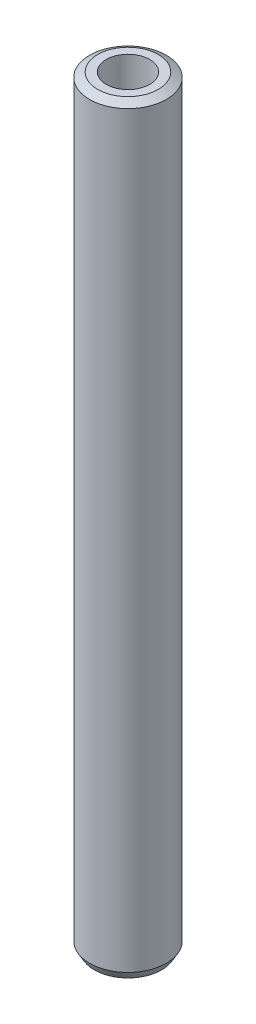
ISO-10303-21;
HEADER;
FILE_DESCRIPTION(('STEP AP214'),'2;1');
FILE_NAME('part.step','',(''),(''),'','','');
FILE_SCHEMA(('AUTOMOTIVE_DESIGN { 1 0 10303 214 1 1 1 1 }'));
ENDSEC;
DATA;
#1=APPLICATION_CONTEXT('core data for automotive mechanical design processes');
#2=APPLICATION_PROTOCOL_DEFINITION('international standard','automotive_design',2000,#1);
#3=PRODUCT_CONTEXT('',#1,'mechanical');
#4=PRODUCT('Part','Part','',(#3));
#5=PRODUCT_RELATED_PRODUCT_CATEGORY('part','',(#4));
#6=PRODUCT_DEFINITION_FORMATION('','',#4);
#7=PRODUCT_DEFINITION_CONTEXT('part definition',#1,'design');
#8=PRODUCT_DEFINITION('design','',#6,#7);
#9=PRODUCT_DEFINITION_SHAPE('','',#8);
#10=(LENGTH_UNIT() NAMED_UNIT(*) SI_UNIT(.MILLI.,.METRE.));
#11=(NAMED_UNIT(*) PLANE_ANGLE_UNIT() SI_UNIT($,.RADIAN.));
#12=(NAMED_UNIT(*) SI_UNIT($,.STERADIAN.) SOLID_ANGLE_UNIT());
#13=UNCERTAINTY_MEASURE_WITH_UNIT(LENGTH_MEASURE(1.E-05),#10,'distance_accuracy_value','');
#14=(GEOMETRIC_REPRESENTATION_CONTEXT(3) GLOBAL_UNCERTAINTY_ASSIGNED_CONTEXT((#13)) GLOBAL_UNIT_ASSIGNED_CONTEXT((#10,
#11,#12)) REPRESENTATION_CONTEXT('',''));
#15=CARTESIAN_POINT('',(0.,0.,0.));
#16=DIRECTION('',(0.,0.,1.));
#17=DIRECTION('',(1.,0.,0.));
#18=AXIS2_PLACEMENT_3D('',#15,#16,#17);
#19=CARTESIAN_POINT('',(0.,545.213989010294,0.));
#20=DIRECTION('',(0.,-1.,0.));
#21=DIRECTION('',(0.,0.,-1.));
#22=AXIS2_PLACEMENT_3D('',#19,#20,#21);
#23=CYLINDRICAL_SURFACE('',#22,27.5);
#24=CARTESIAN_POINT('',(0.,541.8644109639,0.));
#25=DIRECTION('',(0.,1.,0.));
#26=DIRECTION('',(0.,0.,1.));
#27=AXIS2_PLACEMENT_3D('',#24,#25,#26);
#28=CIRCLE('',#27,27.5);
#29=CARTESIAN_POINT('',(0.,541.8644109639,27.5));
#30=VERTEX_POINT('',#29);
#31=EDGE_CURVE('E50',#30,#30,#28,.F.);
#32=ORIENTED_EDGE('',*,*,#31,.T.);
#33=EDGE_LOOP('',(#32));
#34=FACE_BOUND('',#33,.T.);
#35=CARTESIAN_POINT('',(0.,5.801639360272,0.));
#36=DIRECTION('',(0.,1.,0.));
#37=DIRECTION('',(0.,0.,1.));
#38=AXIS2_PLACEMENT_3D('',#35,#36,#37);
#39=CIRCLE('',#38,27.5);
#40=CARTESIAN_POINT('',(0.,5.801639360272,27.5));
#41=VERTEX_POINT('',#40);
#42=EDGE_CURVE('E51',#41,#41,#39,.T.);
#43=ORIENTED_EDGE('',*,*,#42,.T.);
#44=EDGE_LOOP('',(#43));
#45=FACE_BOUND('',#44,.T.);
#46=ADVANCED_FACE('F39',(#34,#45),#23,.T.);
#47=CARTESIAN_POINT('',(0.,545.213989010294,0.));
#48=DIRECTION('',(0.,1.,0.));
#49=DIRECTION('',(0.,0.,1.));
#50=AXIS2_PLACEMENT_3D('',#47,#48,#49);
#51=PLANE('',#50);
#52=CARTESIAN_POINT('',(0.,545.213989010294,0.));
#53=DIRECTION('',(0.,1.,0.));
#54=DIRECTION('',(0.,0.,1.));
#55=AXIS2_PLACEMENT_3D('',#52,#53,#54);
#56=CIRCLE('',#55,21.6983606397279);
#57=CARTESIAN_POINT('',(0.,545.213989010294,21.6983606397279));
#58=VERTEX_POINT('',#57);
#59=EDGE_CURVE('E54',#58,#58,#56,.T.);
#60=ORIENTED_EDGE('',*,*,#59,.T.);
#61=EDGE_LOOP('',(#60));
#62=FACE_BOUND('',#61,.T.);
#63=CARTESIAN_POINT('',(0.,545.213989010294,0.));
#64=DIRECTION('',(0.,1.,0.));
#65=DIRECTION('',(0.,0.,1.));
#66=AXIS2_PLACEMENT_3D('',#63,#64,#65);
#67=CIRCLE('',#66,15.5353689155938);
#68=CARTESIAN_POINT('',(0.,545.213989010294,15.5353689155938));
#69=VERTEX_POINT('',#68);
#70=EDGE_CURVE('E58',#69,#69,#67,.T.);
#71=ORIENTED_EDGE('',*,*,#70,.F.);
#72=EDGE_LOOP('',(#71));
#73=FACE_BOUND('',#72,.T.);
#74=ADVANCED_FACE('F69',(#62,#73),#51,.T.);
#75=CARTESIAN_POINT('',(0.,0.,0.));
#76=DIRECTION('',(0.,1.,0.));
#77=DIRECTION('',(0.,0.,1.));
#78=AXIS2_PLACEMENT_3D('',#75,#76,#77);
#79=PLANE('',#78);
#80=CARTESIAN_POINT('',(0.,0.,0.));
#81=DIRECTION('',(0.,1.,0.));
#82=DIRECTION('',(0.,0.,1.));
#83=AXIS2_PLACEMENT_3D('',#80,#81,#82);
#84=CIRCLE('',#83,24.1504219536058);
#85=CARTESIAN_POINT('',(0.,0.,24.1504219536058));
#86=VERTEX_POINT('',#85);
#87=EDGE_CURVE('E10',#86,#86,#84,.F.);
#88=ORIENTED_EDGE('',*,*,#87,.T.);
#89=EDGE_LOOP('',(#88));
#90=FACE_BOUND('',#89,.T.);
#91=CARTESIAN_POINT('',(0.,0.,0.));
#92=DIRECTION('',(0.,1.,0.));
#93=DIRECTION('',(0.,0.,1.));
#94=AXIS2_PLACEMENT_3D('',#91,#92,#93);
#95=CIRCLE('',#94,15.5353689155938);
#96=CARTESIAN_POINT('',(0.,0.,15.5353689155938));
#97=VERTEX_POINT('',#96);
#98=EDGE_CURVE('E63',#97,#97,#95,.T.);
#99=ORIENTED_EDGE('',*,*,#98,.T.);
#100=EDGE_LOOP('',(#99));
#101=FACE_BOUND('',#100,.T.);
#102=ADVANCED_FACE('F75',(#90,#101),#79,.F.);
#103=CARTESIAN_POINT('',(0.,545.213989010294,0.));
#104=DIRECTION('',(0.,-1.,0.));
#105=DIRECTION('',(0.,0.,-1.));
#106=AXIS2_PLACEMENT_3D('',#103,#104,#105);
#107=CYLINDRICAL_SURFACE('',#106,15.5353689155938);
#108=ORIENTED_EDGE('',*,*,#70,.T.);
#109=EDGE_LOOP('',(#108));
#110=FACE_BOUND('',#109,.T.);
#111=ORIENTED_EDGE('',*,*,#98,.F.);
#112=EDGE_LOOP('',(#111));
#113=FACE_BOUND('',#112,.T.);
#114=ADVANCED_FACE('F70',(#110,#113),#107,.F.);
#115=CARTESIAN_POINT('',(0.,545.213989010294,0.));
#116=DIRECTION('',(0.,-1.,0.));
#117=DIRECTION('',(0.,0.,-1.));
#118=AXIS2_PLACEMENT_3D('',#115,#116,#117);
#119=CONICAL_SURFACE('',#118,21.6983606397279,1.04719755119659);
#120=ORIENTED_EDGE('',*,*,#31,.F.);
#121=EDGE_LOOP('',(#120));
#122=FACE_BOUND('',#121,.T.);
#123=ORIENTED_EDGE('',*,*,#59,.F.);
#124=EDGE_LOOP('',(#123));
#125=FACE_BOUND('',#124,.T.);
#126=ADVANCED_FACE('F81',(#122,#125),#119,.T.);
#127=CARTESIAN_POINT('',(0.,5.801639360272,0.));
#128=DIRECTION('',(0.,1.,0.));
#129=DIRECTION('',(0.,0.,1.));
#130=AXIS2_PLACEMENT_3D('',#127,#128,#129);
#131=CONICAL_SURFACE('',#130,27.5,0.523598775598298);
#132=CARTESIAN_POINT('',(0.,0.,24.1504219536058));
#133=CARTESIAN_POINT('',(0.,0.0604337433361655,24.1853133915891));
#134=CARTESIAN_POINT('',(0.,0.120867486672332,24.2202048295724));
#135=CARTESIAN_POINT('',(0.,0.241734973344666,24.2899877055389));
#136=CARTESIAN_POINT('',(0.,0.302168716680833,24.3248791435222));
#137=CARTESIAN_POINT('',(0.,0.423036203353166,24.3946620194887));
#138=CARTESIAN_POINT('',(0.,0.483469946689333,24.429553457472));
#139=CARTESIAN_POINT('',(0.,0.604337433361666,24.4993363334386));
#140=CARTESIAN_POINT('',(0.,0.664771176697833,24.5342277714218));
#141=CARTESIAN_POINT('',(0.,0.785638663370167,24.6040106473884));
#142=CARTESIAN_POINT('',(0.,0.846072406706333,24.6389020853717));
#143=CARTESIAN_POINT('',(0.,0.966939893378667,24.7086849613382));
#144=CARTESIAN_POINT('',(0.,1.02737363671483,24.7435763993215));
#145=CARTESIAN_POINT('',(0.,1.14824112338717,24.813359275288));
#146=CARTESIAN_POINT('',(0.,1.20867486672333,24.8482507132713));
#147=CARTESIAN_POINT('',(0.,1.32954235339567,24.9180335892378));
#148=CARTESIAN_POINT('',(0.,1.38997609673183,24.9529250272211));
#149=CARTESIAN_POINT('',(0.,1.51084358340417,25.0227079031877));
#150=CARTESIAN_POINT('',(0.,1.57127732674033,25.0575993411709));
#151=CARTESIAN_POINT('',(0.,1.69214481341267,25.1273822171375));
#152=CARTESIAN_POINT('',(0.,1.75257855674883,25.1622736551207));
#153=CARTESIAN_POINT('',(0.,1.87344604342117,25.2320565310873));
#154=CARTESIAN_POINT('',(0.,1.93387978675733,25.2669479690706));
#155=CARTESIAN_POINT('',(0.,2.05474727342967,25.3367308450371));
#156=CARTESIAN_POINT('',(0.,2.11518101676583,25.3716222830204));
#157=CARTESIAN_POINT('',(0.,2.23604850343817,25.4414051589869));
#158=CARTESIAN_POINT('',(0.,2.29648224677433,25.4762965969702));
#159=CARTESIAN_POINT('',(0.,2.41734973344667,25.5460794729367));
#160=CARTESIAN_POINT('',(0.,2.47778347678283,25.58097091092));
#161=CARTESIAN_POINT('',(0.,2.59865096345517,25.6507537868866));
#162=CARTESIAN_POINT('',(0.,2.65908470679133,25.6856452248698));
#163=CARTESIAN_POINT('',(0.,2.77995219346367,25.7554281008364));
#164=CARTESIAN_POINT('',(0.,2.84038593679983,25.7903195388196));
#165=CARTESIAN_POINT('',(0.,2.96125342347217,25.8601024147862));
#166=CARTESIAN_POINT('',(0.,3.02168716680833,25.8949938527695));
#167=CARTESIAN_POINT('',(0.,3.14255465348067,25.964776728736));
#168=CARTESIAN_POINT('',(0.,3.20298839681683,25.9996681667193));
#169=CARTESIAN_POINT('',(0.,3.32385588348917,26.0694510426858));
#170=CARTESIAN_POINT('',(0.,3.38428962682533,26.1043424806691));
#171=CARTESIAN_POINT('',(0.,3.50515711349767,26.1741253566356));
#172=CARTESIAN_POINT('',(0.,3.56559085683383,26.2090167946189));
#173=CARTESIAN_POINT('',(0.,3.68645834350617,26.2787996705855));
#174=CARTESIAN_POINT('',(0.,3.74689208684234,26.3136911085687));
#175=CARTESIAN_POINT('',(0.,3.86775957351467,26.3834739845353));
#176=CARTESIAN_POINT('',(0.,3.92819331685083,26.4183654225186));
#177=CARTESIAN_POINT('',(0.,4.04906080352317,26.4881482984851));
#178=CARTESIAN_POINT('',(0.,4.10949454685933,26.5230397364684));
#179=CARTESIAN_POINT('',(0.,4.23036203353167,26.5928226124349));
#180=CARTESIAN_POINT('',(0.,4.29079577686784,26.6277140504182));
#181=CARTESIAN_POINT('',(0.,4.41166326354017,26.6974969263847));
#182=CARTESIAN_POINT('',(0.,4.47209700687633,26.732388364368));
#183=CARTESIAN_POINT('',(0.,4.59296449354867,26.8021712403346));
#184=CARTESIAN_POINT('',(0.,4.65339823688484,26.8370626783178));
#185=CARTESIAN_POINT('',(0.,4.77426572355717,26.9068455542844));
#186=CARTESIAN_POINT('',(0.,4.83469946689334,26.9417369922676));
#187=CARTESIAN_POINT('',(0.,4.95556695356567,27.0115198682342));
#188=CARTESIAN_POINT('',(0.,5.01600069690183,27.0464113062175));
#189=CARTESIAN_POINT('',(0.,5.13686818357417,27.116194182184));
#190=CARTESIAN_POINT('',(0.,5.19730192691034,27.1510856201673));
#191=CARTESIAN_POINT('',(0.,5.31816941358267,27.2208684961338));
#192=CARTESIAN_POINT('',(0.,5.37860315691884,27.2557599341171));
#193=CARTESIAN_POINT('',(0.,5.49947064359117,27.3255428100836));
#194=CARTESIAN_POINT('',(0.,5.55990438692734,27.3604342480669));
#195=CARTESIAN_POINT('',(0.,5.68077187359967,27.4302171240335));
#196=CARTESIAN_POINT('',(0.,5.74120561693584,27.4651085620167));
#197=CARTESIAN_POINT('',(0.,5.801639360272,27.5));
#198=B_SPLINE_CURVE_WITH_KNOTS('',3,(#132,#133,#134,#135,#136,#137,#138,#139,#140,#141,#142,
#143,#144,#145,#146,#147,#148,#149,#150,#151,#152,#153,#154,#155,#156,#157,#158,#159,#160,#161,
#162,#163,#164,#165,#166,#167,#168,#169,#170,#171,#172,#173,#174,#175,#176,#177,#178,#179,#180,
#181,#182,#183,#184,#185,#186,#187,#188,#189,#190,#191,#192,#193,#194,#195,#196,#197),
.UNSPECIFIED.,.F.,.F.,(4,2,2,2,2,2,2,2,2,2,2,2,2,2,2,2,2,2,2,2,2,2,2,2,2,2,2,2,2,2,2,2,4),(0.,
0.209348627899635,0.41869725579927,0.628045883698907,0.837394511598542,1.04674313949818,
1.25609176739781,1.46544039529745,1.67478902319708,1.88413765109672,2.09348627899635,
2.30283490689599,2.51218353479563,2.72153216269526,2.9308807905949,3.14022941849453,
3.34957804639417,3.5589266742938,3.76827530219344,3.97762393009307,4.18697255799271,
4.39632118589234,4.60566981379198,4.81501844169162,5.02436706959125,5.23371569749089,
5.44306432539052,5.65241295329016,5.86176158118979,6.07111020908943,6.28045883698906,
6.4898074648887,6.69915609278833),.UNSPECIFIED.);
#199=EDGE_CURVE('BSEAM45',#86,#41,#198,.T.);
#200=ORIENTED_EDGE('',*,*,#87,.F.);
#201=ORIENTED_EDGE('',*,*,#42,.F.);
#202=ORIENTED_EDGE('',*,*,#199,.T.);
#203=ORIENTED_EDGE('',*,*,#199,.F.);
#204=EDGE_LOOP('',(#200,#202,#201,#203));
#205=FACE_BOUND('',#204,.T.);
#206=ADVANCED_FACE('F45',(#205),#131,.T.);
#207=CLOSED_SHELL('',(#46,#74,#102,#114,#126,#206));
#208=MANIFOLD_SOLID_BREP('B2',#207);
#209=ADVANCED_BREP_SHAPE_REPRESENTATION('',(#18,#208),#14);
#210=SHAPE_DEFINITION_REPRESENTATION(#9,#209);
ENDSEC;
END-ISO-10303-21;
